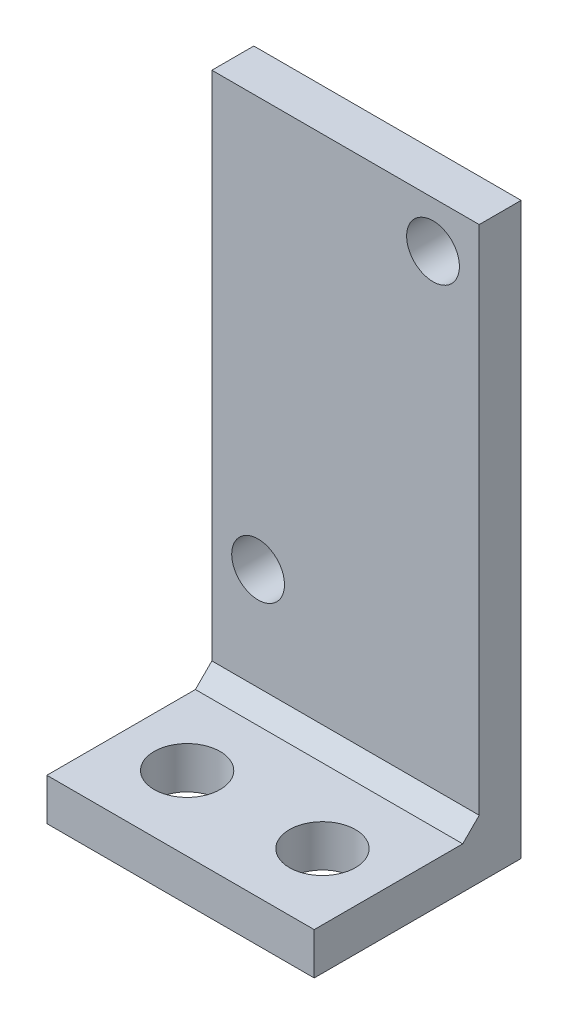
ISO-10303-21;
HEADER;
FILE_DESCRIPTION(('STEP AP214'),'2;1');
FILE_NAME('part.step','',(''),(''),'','','');
FILE_SCHEMA(('AUTOMOTIVE_DESIGN { 1 0 10303 214 1 1 1 1 }'));
ENDSEC;
DATA;
#1=APPLICATION_CONTEXT('core data for automotive mechanical design processes');
#2=APPLICATION_PROTOCOL_DEFINITION('international standard','automotive_design',2000,#1);
#3=PRODUCT_CONTEXT('',#1,'mechanical');
#4=PRODUCT('Part','Part','',(#3));
#5=PRODUCT_RELATED_PRODUCT_CATEGORY('part','',(#4));
#6=PRODUCT_DEFINITION_FORMATION('','',#4);
#7=PRODUCT_DEFINITION_CONTEXT('part definition',#1,'design');
#8=PRODUCT_DEFINITION('design','',#6,#7);
#9=PRODUCT_DEFINITION_SHAPE('','',#8);
#10=(LENGTH_UNIT() NAMED_UNIT(*) SI_UNIT(.MILLI.,.METRE.));
#11=(NAMED_UNIT(*) PLANE_ANGLE_UNIT() SI_UNIT($,.RADIAN.));
#12=(NAMED_UNIT(*) SI_UNIT($,.STERADIAN.) SOLID_ANGLE_UNIT());
#13=UNCERTAINTY_MEASURE_WITH_UNIT(LENGTH_MEASURE(1.E-05),#10,'distance_accuracy_value','');
#14=(GEOMETRIC_REPRESENTATION_CONTEXT(3) GLOBAL_UNCERTAINTY_ASSIGNED_CONTEXT((#13)) GLOBAL_UNIT_ASSIGNED_CONTEXT((#10,
#11,#12)) REPRESENTATION_CONTEXT('',''));
#15=CARTESIAN_POINT('',(0.,0.,0.));
#16=DIRECTION('',(0.,0.,1.));
#17=DIRECTION('',(1.,0.,0.));
#18=AXIS2_PLACEMENT_3D('',#15,#16,#17);
#19=CARTESIAN_POINT('',(0.,0.,2.54));
#20=DIRECTION('',(0.,0.,-1.));
#21=DIRECTION('',(-1.,0.,0.));
#22=AXIS2_PLACEMENT_3D('',#19,#20,#21);
#23=PLANE('',#22);
#24=CARTESIAN_POINT('',(2.8,9.74000000000001,2.54));
#25=DIRECTION('',(0.,0.,-1.));
#26=DIRECTION('',(-1.,0.,0.));
#27=AXIS2_PLACEMENT_3D('',#24,#25,#26);
#28=CIRCLE('',#27,1.6);
#29=CARTESIAN_POINT('',(1.2,9.74000000000001,2.54));
#30=VERTEX_POINT('',#29);
#31=EDGE_CURVE('E224',#30,#30,#28,.T.);
#32=ORIENTED_EDGE('',*,*,#31,.T.);
#33=EDGE_LOOP('',(#32));
#34=FACE_BOUND('',#33,.T.);
#35=CARTESIAN_POINT('',(13.4,31.74,2.54));
#36=DIRECTION('',(0.,0.,-1.));
#37=DIRECTION('',(-1.,0.,0.));
#38=AXIS2_PLACEMENT_3D('',#35,#36,#37);
#39=CIRCLE('',#38,1.6);
#40=CARTESIAN_POINT('',(11.8,31.74,2.54));
#41=VERTEX_POINT('',#40);
#42=EDGE_CURVE('E114',#41,#41,#39,.T.);
#43=ORIENTED_EDGE('',*,*,#42,.T.);
#44=EDGE_LOOP('',(#43));
#45=FACE_BOUND('',#44,.T.);
#46=DIRECTION('',(0.,-1.,0.));
#47=VECTOR('',#46,1.);
#48=CARTESIAN_POINT('',(0.,0.,2.54));
#49=LINE('',#48,#47);
#50=CARTESIAN_POINT('',(0.,34.54,2.54));
#51=VERTEX_POINT('',#50);
#52=CARTESIAN_POINT('',(0.,3.54,2.54));
#53=VERTEX_POINT('',#52);
#54=EDGE_CURVE('E128',#51,#53,#49,.T.);
#55=ORIENTED_EDGE('',*,*,#54,.T.);
#56=DIRECTION('',(1.,0.,0.));
#57=VECTOR('',#56,1.);
#58=CARTESIAN_POINT('',(16.2,3.54,2.54));
#59=LINE('',#58,#57);
#60=CARTESIAN_POINT('',(16.2,3.54,2.54));
#61=VERTEX_POINT('',#60);
#62=EDGE_CURVE('E53',#53,#61,#59,.T.);
#63=ORIENTED_EDGE('',*,*,#62,.T.);
#64=DIRECTION('',(0.,1.,0.));
#65=VECTOR('',#64,1.);
#66=CARTESIAN_POINT('',(16.2,0.,2.54));
#67=LINE('',#66,#65);
#68=CARTESIAN_POINT('',(16.2,34.54,2.54));
#69=VERTEX_POINT('',#68);
#70=EDGE_CURVE('E130',#61,#69,#67,.T.);
#71=ORIENTED_EDGE('',*,*,#70,.T.);
#72=DIRECTION('',(-1.,0.,0.));
#73=VECTOR('',#72,1.);
#74=CARTESIAN_POINT('',(0.,34.54,2.54));
#75=LINE('',#74,#73);
#76=EDGE_CURVE('E133',#69,#51,#75,.T.);
#77=ORIENTED_EDGE('',*,*,#76,.T.);
#78=EDGE_LOOP('',(#55,#63,#71,#77));
#79=FACE_BOUND('',#78,.T.);
#80=ADVANCED_FACE('F32',(#34,#45,#79),#23,.F.);
#81=CARTESIAN_POINT('',(0.,0.,2.54));
#82=DIRECTION('',(1.,0.,0.));
#83=DIRECTION('',(0.,0.,-1.));
#84=AXIS2_PLACEMENT_3D('',#81,#82,#83);
#85=PLANE('',#84);
#86=DIRECTION('',(0.,-1.,0.));
#87=VECTOR('',#86,1.);
#88=CARTESIAN_POINT('',(0.,0.,0.));
#89=LINE('',#88,#87);
#90=CARTESIAN_POINT('',(0.,34.54,0.));
#91=VERTEX_POINT('',#90);
#92=CARTESIAN_POINT('',(0.,0.,0.));
#93=VERTEX_POINT('',#92);
#94=EDGE_CURVE('E97',#91,#93,#89,.T.);
#95=ORIENTED_EDGE('',*,*,#94,.T.);
#96=DIRECTION('',(0.,0.,-1.));
#97=VECTOR('',#96,1.);
#98=CARTESIAN_POINT('',(0.,0.,2.54));
#99=LINE('',#98,#97);
#100=CARTESIAN_POINT('',(0.,0.,12.54));
#101=VERTEX_POINT('',#100);
#102=EDGE_CURVE('E90',#101,#93,#99,.T.);
#103=ORIENTED_EDGE('',*,*,#102,.F.);
#104=DIRECTION('',(0.,-1.,0.));
#105=VECTOR('',#104,1.);
#106=CARTESIAN_POINT('',(0.,0.,12.54));
#107=LINE('',#106,#105);
#108=CARTESIAN_POINT('',(0.,2.54,12.54));
#109=VERTEX_POINT('',#108);
#110=EDGE_CURVE('E94',#109,#101,#107,.T.);
#111=ORIENTED_EDGE('',*,*,#110,.F.);
#112=DIRECTION('',(0.,0.,-1.));
#113=VECTOR('',#112,1.);
#114=CARTESIAN_POINT('',(0.,2.54,12.54));
#115=LINE('',#114,#113);
#116=CARTESIAN_POINT('',(0.,2.54,3.54000000000001));
#117=VERTEX_POINT('',#116);
#118=EDGE_CURVE('E123',#109,#117,#115,.T.);
#119=ORIENTED_EDGE('',*,*,#118,.T.);
#120=DIRECTION('',(0.,-0.707106781186544,0.707106781186551));
#121=VECTOR('',#120,1.);
#122=CARTESIAN_POINT('',(0.,1.77000000000002,4.31));
#123=LINE('',#122,#121);
#124=EDGE_CURVE('E40',#117,#53,#123,.F.);
#125=ORIENTED_EDGE('',*,*,#124,.T.);
#126=ORIENTED_EDGE('',*,*,#54,.F.);
#127=DIRECTION('',(0.,0.,-1.));
#128=VECTOR('',#127,1.);
#129=CARTESIAN_POINT('',(0.,34.54,2.54));
#130=LINE('',#129,#128);
#131=EDGE_CURVE('E135',#51,#91,#130,.T.);
#132=ORIENTED_EDGE('',*,*,#131,.T.);
#133=EDGE_LOOP('',(#95,#103,#111,#119,#125,#126,#132));
#134=FACE_BOUND('',#133,.T.);
#135=ADVANCED_FACE('F92',(#134),#85,.F.);
#136=CARTESIAN_POINT('',(0.,0.,2.54));
#137=DIRECTION('',(0.,1.,0.));
#138=DIRECTION('',(0.,0.,1.));
#139=AXIS2_PLACEMENT_3D('',#136,#137,#138);
#140=PLANE('',#139);
#141=CARTESIAN_POINT('',(4.,0.,8.04000000000001));
#142=DIRECTION('',(0.,1.,0.));
#143=DIRECTION('',(0.,0.,1.));
#144=AXIS2_PLACEMENT_3D('',#141,#142,#143);
#145=CIRCLE('',#144,2.);
#146=CARTESIAN_POINT('',(4.,0.,10.04));
#147=VERTEX_POINT('',#146);
#148=EDGE_CURVE('E210',#147,#147,#145,.T.);
#149=ORIENTED_EDGE('',*,*,#148,.T.);
#150=EDGE_LOOP('',(#149));
#151=FACE_BOUND('',#150,.T.);
#152=CARTESIAN_POINT('',(12.2,0.,8.04000000000001));
#153=DIRECTION('',(0.,1.,0.));
#154=DIRECTION('',(0.,0.,1.));
#155=AXIS2_PLACEMENT_3D('',#152,#153,#154);
#156=CIRCLE('',#155,2.);
#157=CARTESIAN_POINT('',(12.2,0.,10.04));
#158=VERTEX_POINT('',#157);
#159=EDGE_CURVE('E218',#158,#158,#156,.T.);
#160=ORIENTED_EDGE('',*,*,#159,.T.);
#161=EDGE_LOOP('',(#160));
#162=FACE_BOUND('',#161,.T.);
#163=DIRECTION('',(1.,0.,0.));
#164=VECTOR('',#163,1.);
#165=CARTESIAN_POINT('',(0.,0.,0.));
#166=LINE('',#165,#164);
#167=CARTESIAN_POINT('',(16.2,0.,0.));
#168=VERTEX_POINT('',#167);
#169=EDGE_CURVE('E137',#93,#168,#166,.T.);
#170=ORIENTED_EDGE('',*,*,#169,.T.);
#171=DIRECTION('',(0.,0.,-1.));
#172=VECTOR('',#171,1.);
#173=CARTESIAN_POINT('',(16.2,0.,2.54));
#174=LINE('',#173,#172);
#175=CARTESIAN_POINT('',(16.2,0.,12.54));
#176=VERTEX_POINT('',#175);
#177=EDGE_CURVE('E100',#176,#168,#174,.T.);
#178=ORIENTED_EDGE('',*,*,#177,.F.);
#179=DIRECTION('',(1.,0.,0.));
#180=VECTOR('',#179,1.);
#181=CARTESIAN_POINT('',(0.,0.,12.54));
#182=LINE('',#181,#180);
#183=EDGE_CURVE('E103',#101,#176,#182,.T.);
#184=ORIENTED_EDGE('',*,*,#183,.F.);
#185=ORIENTED_EDGE('',*,*,#102,.T.);
#186=EDGE_LOOP('',(#170,#178,#184,#185));
#187=FACE_BOUND('',#186,.T.);
#188=ADVANCED_FACE('F104',(#151,#162,#187),#140,.F.);
#189=CARTESIAN_POINT('',(16.2,0.,2.54));
#190=DIRECTION('',(-1.,0.,0.));
#191=DIRECTION('',(0.,0.,1.));
#192=AXIS2_PLACEMENT_3D('',#189,#190,#191);
#193=PLANE('',#192);
#194=DIRECTION('',(0.,1.,0.));
#195=VECTOR('',#194,1.);
#196=CARTESIAN_POINT('',(16.2,0.,0.));
#197=LINE('',#196,#195);
#198=CARTESIAN_POINT('',(16.2,34.54,0.));
#199=VERTEX_POINT('',#198);
#200=EDGE_CURVE('E139',#168,#199,#197,.T.);
#201=ORIENTED_EDGE('',*,*,#200,.T.);
#202=DIRECTION('',(0.,0.,-1.));
#203=VECTOR('',#202,1.);
#204=CARTESIAN_POINT('',(16.2,34.54,2.54));
#205=LINE('',#204,#203);
#206=EDGE_CURVE('E143',#69,#199,#205,.T.);
#207=ORIENTED_EDGE('',*,*,#206,.F.);
#208=ORIENTED_EDGE('',*,*,#70,.F.);
#209=DIRECTION('',(0.,0.707106781186544,-0.707106781186551));
#210=VECTOR('',#209,1.);
#211=CARTESIAN_POINT('',(16.2,1.77000000000002,4.31));
#212=LINE('',#211,#210);
#213=CARTESIAN_POINT('',(16.2,2.54,3.54000000000001));
#214=VERTEX_POINT('',#213);
#215=EDGE_CURVE('E11',#61,#214,#212,.F.);
#216=ORIENTED_EDGE('',*,*,#215,.T.);
#217=DIRECTION('',(0.,0.,-1.));
#218=VECTOR('',#217,1.);
#219=CARTESIAN_POINT('',(16.2,2.54,12.54));
#220=LINE('',#219,#218);
#221=CARTESIAN_POINT('',(16.2,2.54,12.54));
#222=VERTEX_POINT('',#221);
#223=EDGE_CURVE('E125',#222,#214,#220,.T.);
#224=ORIENTED_EDGE('',*,*,#223,.F.);
#225=DIRECTION('',(0.,1.,0.));
#226=VECTOR('',#225,1.);
#227=CARTESIAN_POINT('',(16.2,0.,12.54));
#228=LINE('',#227,#226);
#229=EDGE_CURVE('E108',#176,#222,#228,.T.);
#230=ORIENTED_EDGE('',*,*,#229,.F.);
#231=ORIENTED_EDGE('',*,*,#177,.T.);
#232=EDGE_LOOP('',(#201,#207,#208,#216,#224,#230,#231));
#233=FACE_BOUND('',#232,.T.);
#234=ADVANCED_FACE('F156',(#233),#193,.F.);
#235=CARTESIAN_POINT('',(0.,34.54,2.54));
#236=DIRECTION('',(0.,-1.,0.));
#237=DIRECTION('',(0.,0.,-1.));
#238=AXIS2_PLACEMENT_3D('',#235,#236,#237);
#239=PLANE('',#238);
#240=DIRECTION('',(-1.,0.,0.));
#241=VECTOR('',#240,1.);
#242=CARTESIAN_POINT('',(0.,34.54,0.));
#243=LINE('',#242,#241);
#244=EDGE_CURVE('E131',#199,#91,#243,.T.);
#245=ORIENTED_EDGE('',*,*,#244,.T.);
#246=ORIENTED_EDGE('',*,*,#131,.F.);
#247=ORIENTED_EDGE('',*,*,#76,.F.);
#248=ORIENTED_EDGE('',*,*,#206,.T.);
#249=EDGE_LOOP('',(#245,#246,#247,#248));
#250=FACE_BOUND('',#249,.T.);
#251=ADVANCED_FACE('F161',(#250),#239,.F.);
#252=CARTESIAN_POINT('',(0.,0.,0.));
#253=DIRECTION('',(0.,0.,-1.));
#254=DIRECTION('',(-1.,0.,0.));
#255=AXIS2_PLACEMENT_3D('',#252,#253,#254);
#256=PLANE('',#255);
#257=CARTESIAN_POINT('',(2.8,9.74000000000001,0.));
#258=DIRECTION('',(0.,0.,-1.));
#259=DIRECTION('',(-1.,0.,0.));
#260=AXIS2_PLACEMENT_3D('',#257,#258,#259);
#261=CIRCLE('',#260,1.6);
#262=CARTESIAN_POINT('',(1.2,9.74000000000001,0.));
#263=VERTEX_POINT('',#262);
#264=EDGE_CURVE('E221',#263,#263,#261,.T.);
#265=ORIENTED_EDGE('',*,*,#264,.F.);
#266=EDGE_LOOP('',(#265));
#267=FACE_BOUND('',#266,.T.);
#268=CARTESIAN_POINT('',(13.4,31.74,0.));
#269=DIRECTION('',(0.,0.,-1.));
#270=DIRECTION('',(-1.,0.,0.));
#271=AXIS2_PLACEMENT_3D('',#268,#269,#270);
#272=CIRCLE('',#271,1.6);
#273=CARTESIAN_POINT('',(11.8,31.74,0.));
#274=VERTEX_POINT('',#273);
#275=EDGE_CURVE('E117',#274,#274,#272,.T.);
#276=ORIENTED_EDGE('',*,*,#275,.F.);
#277=EDGE_LOOP('',(#276));
#278=FACE_BOUND('',#277,.T.);
#279=ORIENTED_EDGE('',*,*,#94,.F.);
#280=ORIENTED_EDGE('',*,*,#244,.F.);
#281=ORIENTED_EDGE('',*,*,#200,.F.);
#282=ORIENTED_EDGE('',*,*,#169,.F.);
#283=EDGE_LOOP('',(#279,#280,#281,#282));
#284=FACE_BOUND('',#283,.T.);
#285=ADVANCED_FACE('F164',(#267,#278,#284),#256,.T.);
#286=CARTESIAN_POINT('',(0.,2.54,12.54));
#287=DIRECTION('',(0.,-1.,0.));
#288=DIRECTION('',(0.,0.,-1.));
#289=AXIS2_PLACEMENT_3D('',#286,#287,#288);
#290=PLANE('',#289);
#291=CARTESIAN_POINT('',(4.,2.54,8.04000000000001));
#292=DIRECTION('',(0.,1.,0.));
#293=DIRECTION('',(0.,0.,1.));
#294=AXIS2_PLACEMENT_3D('',#291,#292,#293);
#295=CIRCLE('',#294,2.);
#296=CARTESIAN_POINT('',(4.,2.54,10.04));
#297=VERTEX_POINT('',#296);
#298=EDGE_CURVE('E213',#297,#297,#295,.T.);
#299=ORIENTED_EDGE('',*,*,#298,.F.);
#300=EDGE_LOOP('',(#299));
#301=FACE_BOUND('',#300,.T.);
#302=CARTESIAN_POINT('',(12.2,2.54,8.04000000000001));
#303=DIRECTION('',(0.,1.,0.));
#304=DIRECTION('',(0.,0.,1.));
#305=AXIS2_PLACEMENT_3D('',#302,#303,#304);
#306=CIRCLE('',#305,2.);
#307=CARTESIAN_POINT('',(12.2,2.54,10.04));
#308=VERTEX_POINT('',#307);
#309=EDGE_CURVE('E215',#308,#308,#306,.T.);
#310=ORIENTED_EDGE('',*,*,#309,.F.);
#311=EDGE_LOOP('',(#310));
#312=FACE_BOUND('',#311,.T.);
#313=ORIENTED_EDGE('',*,*,#223,.T.);
#314=DIRECTION('',(-1.,0.,0.));
#315=VECTOR('',#314,1.);
#316=CARTESIAN_POINT('',(0.,2.54,3.54000000000001));
#317=LINE('',#316,#315);
#318=EDGE_CURVE('E99',#214,#117,#317,.T.);
#319=ORIENTED_EDGE('',*,*,#318,.T.);
#320=ORIENTED_EDGE('',*,*,#118,.F.);
#321=DIRECTION('',(-1.,0.,0.));
#322=VECTOR('',#321,1.);
#323=CARTESIAN_POINT('',(0.,2.54,12.54));
#324=LINE('',#323,#322);
#325=EDGE_CURVE('E112',#222,#109,#324,.T.);
#326=ORIENTED_EDGE('',*,*,#325,.F.);
#327=EDGE_LOOP('',(#313,#319,#320,#326));
#328=FACE_BOUND('',#327,.T.);
#329=ADVANCED_FACE('F151',(#301,#312,#328),#290,.F.);
#330=CARTESIAN_POINT('',(0.,0.,12.54));
#331=DIRECTION('',(0.,0.,-1.));
#332=DIRECTION('',(-1.,0.,0.));
#333=AXIS2_PLACEMENT_3D('',#330,#331,#332);
#334=PLANE('',#333);
#335=ORIENTED_EDGE('',*,*,#110,.T.);
#336=ORIENTED_EDGE('',*,*,#183,.T.);
#337=ORIENTED_EDGE('',*,*,#229,.T.);
#338=ORIENTED_EDGE('',*,*,#325,.T.);
#339=EDGE_LOOP('',(#335,#336,#337,#338));
#340=FACE_BOUND('',#339,.T.);
#341=ADVANCED_FACE('F110',(#340),#334,.F.);
#342=CARTESIAN_POINT('',(0.,2.54,3.54000000000001));
#343=DIRECTION('',(0.,0.707106781186551,0.707106781186544));
#344=DIRECTION('',(1.,0.,0.));
#345=AXIS2_PLACEMENT_3D('',#342,#343,#344);
#346=PLANE('',#345);
#347=ORIENTED_EDGE('',*,*,#215,.F.);
#348=ORIENTED_EDGE('',*,*,#62,.F.);
#349=ORIENTED_EDGE('',*,*,#124,.F.);
#350=ORIENTED_EDGE('',*,*,#318,.F.);
#351=EDGE_LOOP('',(#347,#348,#349,#350));
#352=FACE_BOUND('',#351,.T.);
#353=ADVANCED_FACE('F34',(#352),#346,.T.);
#354=CARTESIAN_POINT('',(13.4,31.74,2.54));
#355=DIRECTION('',(0.,0.,-1.));
#356=DIRECTION('',(-1.,0.,0.));
#357=AXIS2_PLACEMENT_3D('',#354,#355,#356);
#358=CYLINDRICAL_SURFACE('',#357,1.6);
#359=ORIENTED_EDGE('',*,*,#42,.F.);
#360=EDGE_LOOP('',(#359));
#361=FACE_BOUND('',#360,.T.);
#362=ORIENTED_EDGE('',*,*,#275,.T.);
#363=EDGE_LOOP('',(#362));
#364=FACE_BOUND('',#363,.T.);
#365=ADVANCED_FACE('F190',(#361,#364),#358,.F.);
#366=CARTESIAN_POINT('',(2.8,9.74000000000001,2.54));
#367=DIRECTION('',(0.,0.,-1.));
#368=DIRECTION('',(-1.,0.,0.));
#369=AXIS2_PLACEMENT_3D('',#366,#367,#368);
#370=CYLINDRICAL_SURFACE('',#369,1.6);
#371=ORIENTED_EDGE('',*,*,#31,.F.);
#372=EDGE_LOOP('',(#371));
#373=FACE_BOUND('',#372,.T.);
#374=ORIENTED_EDGE('',*,*,#264,.T.);
#375=EDGE_LOOP('',(#374));
#376=FACE_BOUND('',#375,.T.);
#377=ADVANCED_FACE('F193',(#373,#376),#370,.F.);
#378=CARTESIAN_POINT('',(12.2,0.,8.04000000000001));
#379=DIRECTION('',(0.,1.,0.));
#380=DIRECTION('',(0.,0.,1.));
#381=AXIS2_PLACEMENT_3D('',#378,#379,#380);
#382=CYLINDRICAL_SURFACE('',#381,2.);
#383=ORIENTED_EDGE('',*,*,#159,.F.);
#384=EDGE_LOOP('',(#383));
#385=FACE_BOUND('',#384,.T.);
#386=ORIENTED_EDGE('',*,*,#309,.T.);
#387=EDGE_LOOP('',(#386));
#388=FACE_BOUND('',#387,.T.);
#389=ADVANCED_FACE('F197',(#385,#388),#382,.F.);
#390=CARTESIAN_POINT('',(4.,0.,8.04000000000001));
#391=DIRECTION('',(0.,1.,0.));
#392=DIRECTION('',(0.,0.,1.));
#393=AXIS2_PLACEMENT_3D('',#390,#391,#392);
#394=CYLINDRICAL_SURFACE('',#393,2.);
#395=ORIENTED_EDGE('',*,*,#148,.F.);
#396=EDGE_LOOP('',(#395));
#397=FACE_BOUND('',#396,.T.);
#398=ORIENTED_EDGE('',*,*,#298,.T.);
#399=EDGE_LOOP('',(#398));
#400=FACE_BOUND('',#399,.T.);
#401=ADVANCED_FACE('F201',(#397,#400),#394,.F.);
#402=CLOSED_SHELL('',(#80,#135,#188,#234,#251,#285,#329,#341,#353,#365,#377,#389,#401));
#403=MANIFOLD_SOLID_BREP('B2',#402);
#404=ADVANCED_BREP_SHAPE_REPRESENTATION('',(#18,#403),#14);
#405=SHAPE_DEFINITION_REPRESENTATION(#9,#404);
ENDSEC;
END-ISO-10303-21;
